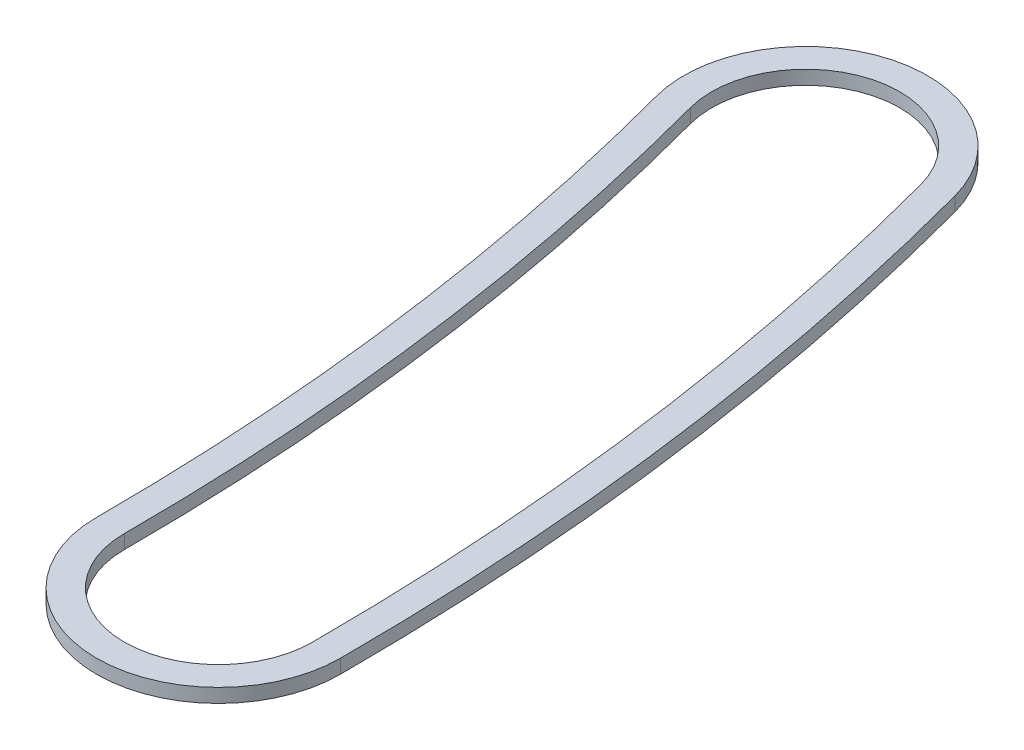
ISO-10303-21;
HEADER;
FILE_DESCRIPTION(('STEP AP214'),'2;1');
FILE_NAME('part.step','',(''),(''),'','','');
FILE_SCHEMA(('AUTOMOTIVE_DESIGN { 1 0 10303 214 1 1 1 1 }'));
ENDSEC;
DATA;
#1=APPLICATION_CONTEXT('core data for automotive mechanical design processes');
#2=APPLICATION_PROTOCOL_DEFINITION('international standard','automotive_design',2000,#1);
#3=PRODUCT_CONTEXT('',#1,'mechanical');
#4=PRODUCT('Part','Part','',(#3));
#5=PRODUCT_RELATED_PRODUCT_CATEGORY('part','',(#4));
#6=PRODUCT_DEFINITION_FORMATION('','',#4);
#7=PRODUCT_DEFINITION_CONTEXT('part definition',#1,'design');
#8=PRODUCT_DEFINITION('design','',#6,#7);
#9=PRODUCT_DEFINITION_SHAPE('','',#8);
#10=(LENGTH_UNIT() NAMED_UNIT(*) SI_UNIT(.MILLI.,.METRE.));
#11=(NAMED_UNIT(*) PLANE_ANGLE_UNIT() SI_UNIT($,.RADIAN.));
#12=(NAMED_UNIT(*) SI_UNIT($,.STERADIAN.) SOLID_ANGLE_UNIT());
#13=UNCERTAINTY_MEASURE_WITH_UNIT(LENGTH_MEASURE(1.E-05),#10,'distance_accuracy_value','');
#14=(GEOMETRIC_REPRESENTATION_CONTEXT(3) GLOBAL_UNCERTAINTY_ASSIGNED_CONTEXT((#13)) GLOBAL_UNIT_ASSIGNED_CONTEXT((#10,
#11,#12)) REPRESENTATION_CONTEXT('',''));
#15=CARTESIAN_POINT('',(0.,0.,0.));
#16=DIRECTION('',(0.,0.,1.));
#17=DIRECTION('',(1.,0.,0.));
#18=AXIS2_PLACEMENT_3D('',#15,#16,#17);
#19=CARTESIAN_POINT('',(47.625,0.508,0.));
#20=DIRECTION('',(0.,1.,0.));
#21=DIRECTION('',(0.,0.,1.));
#22=AXIS2_PLACEMENT_3D('',#19,#20,#21);
#23=PLANE('',#22);
#24=CARTESIAN_POINT('',(95.25,0.508,0.));
#25=DIRECTION('',(0.,1.,0.));
#26=DIRECTION('',(0.,0.,1.));
#27=AXIS2_PLACEMENT_3D('',#24,#25,#26);
#28=CIRCLE('',#27,4.44500000000002);
#29=CARTESIAN_POINT('',(90.805,0.508,0.));
#30=VERTEX_POINT('',#29);
#31=CARTESIAN_POINT('',(99.695,0.508,0.));
#32=VERTEX_POINT('',#31);
#33=EDGE_CURVE('E133',#30,#32,#28,.T.);
#34=ORIENTED_EDGE('',*,*,#33,.T.);
#35=CARTESIAN_POINT('',(0.,0.508,0.));
#36=DIRECTION('',(0.,1.,0.));
#37=DIRECTION('',(0.,0.,1.));
#38=AXIS2_PLACEMENT_3D('',#35,#36,#37);
#39=CIRCLE('',#38,99.695);
#40=CARTESIAN_POINT('',(96.2979752518885,0.508,-25.8029647014966));
#41=VERTEX_POINT('',#40);
#42=EDGE_CURVE('E136',#32,#41,#39,.T.);
#43=ORIENTED_EDGE('',*,*,#42,.T.);
#44=CARTESIAN_POINT('',(92.0044349540336,0.508,-24.6525140460158));
#45=DIRECTION('',(0.,1.,0.));
#46=DIRECTION('',(0.,0.,1.));
#47=AXIS2_PLACEMENT_3D('',#44,#45,#46);
#48=CIRCLE('',#47,4.44500000000002);
#49=CARTESIAN_POINT('',(87.7108946561787,0.508,-23.5020633905351));
#50=VERTEX_POINT('',#49);
#51=EDGE_CURVE('E139',#41,#50,#48,.T.);
#52=ORIENTED_EDGE('',*,*,#51,.T.);
#53=CARTESIAN_POINT('',(0.,0.508,0.));
#54=DIRECTION('',(0.,-1.,0.));
#55=DIRECTION('',(0.,0.,1.));
#56=AXIS2_PLACEMENT_3D('',#53,#54,#55);
#57=CIRCLE('',#56,90.805);
#58=EDGE_CURVE('E141',#50,#30,#57,.T.);
#59=ORIENTED_EDGE('',*,*,#58,.T.);
#60=EDGE_LOOP('',(#34,#43,#52,#59));
#61=FACE_BOUND('',#60,.T.);
#62=CARTESIAN_POINT('',(0.,0.508,0.));
#63=DIRECTION('',(0.,1.,0.));
#64=DIRECTION('',(0.,0.,1.));
#65=AXIS2_PLACEMENT_3D('',#62,#63,#64);
#66=CIRCLE('',#65,98.679);
#67=CARTESIAN_POINT('',(98.679,0.508,0.));
#68=VERTEX_POINT('',#67);
#69=CARTESIAN_POINT('',(95.3165946123788,0.508,-25.5400045516724));
#70=VERTEX_POINT('',#69);
#71=EDGE_CURVE('E105',#68,#70,#66,.T.);
#72=ORIENTED_EDGE('',*,*,#71,.F.);
#73=CARTESIAN_POINT('',(95.25,0.508,0.));
#74=DIRECTION('',(0.,1.,0.));
#75=DIRECTION('',(0.,0.,1.));
#76=AXIS2_PLACEMENT_3D('',#73,#74,#75);
#77=CIRCLE('',#76,3.429);
#78=CARTESIAN_POINT('',(91.821,0.508,0.));
#79=VERTEX_POINT('',#78);
#80=EDGE_CURVE('E97',#79,#68,#77,.T.);
#81=ORIENTED_EDGE('',*,*,#80,.F.);
#82=CARTESIAN_POINT('',(0.,0.508,0.));
#83=DIRECTION('',(0.,-1.,0.));
#84=DIRECTION('',(0.,0.,1.));
#85=AXIS2_PLACEMENT_3D('',#82,#83,#84);
#86=CIRCLE('',#85,91.821);
#87=CARTESIAN_POINT('',(88.6922752956884,0.508,-23.7650235403593));
#88=VERTEX_POINT('',#87);
#89=EDGE_CURVE('E119',#88,#79,#86,.T.);
#90=ORIENTED_EDGE('',*,*,#89,.F.);
#91=CARTESIAN_POINT('',(92.0044349540336,0.508,-24.6525140460158));
#92=DIRECTION('',(0.,1.,0.));
#93=DIRECTION('',(0.,0.,1.));
#94=AXIS2_PLACEMENT_3D('',#91,#92,#93);
#95=CIRCLE('',#94,3.429);
#96=EDGE_CURVE('E117',#70,#88,#95,.T.);
#97=ORIENTED_EDGE('',*,*,#96,.F.);
#98=EDGE_LOOP('',(#72,#81,#90,#97));
#99=FACE_BOUND('',#98,.T.);
#100=ADVANCED_FACE('F32',(#61,#99),#23,.T.);
#101=CARTESIAN_POINT('',(47.625,0.,0.));
#102=DIRECTION('',(0.,1.,0.));
#103=DIRECTION('',(0.,0.,1.));
#104=AXIS2_PLACEMENT_3D('',#101,#102,#103);
#105=PLANE('',#104);
#106=CARTESIAN_POINT('',(95.25,0.,0.));
#107=DIRECTION('',(0.,1.,0.));
#108=DIRECTION('',(0.,0.,1.));
#109=AXIS2_PLACEMENT_3D('',#106,#107,#108);
#110=CIRCLE('',#109,4.44500000000002);
#111=CARTESIAN_POINT('',(90.805,0.,0.));
#112=VERTEX_POINT('',#111);
#113=CARTESIAN_POINT('',(99.695,0.,0.));
#114=VERTEX_POINT('',#113);
#115=EDGE_CURVE('E113',#112,#114,#110,.T.);
#116=ORIENTED_EDGE('',*,*,#115,.F.);
#117=CARTESIAN_POINT('',(0.,0.,0.));
#118=DIRECTION('',(0.,-1.,0.));
#119=DIRECTION('',(0.,0.,1.));
#120=AXIS2_PLACEMENT_3D('',#117,#118,#119);
#121=CIRCLE('',#120,90.805);
#122=CARTESIAN_POINT('',(87.7108946561787,0.,-23.5020633905351));
#123=VERTEX_POINT('',#122);
#124=EDGE_CURVE('E137',#123,#112,#121,.T.);
#125=ORIENTED_EDGE('',*,*,#124,.F.);
#126=CARTESIAN_POINT('',(92.0044349540336,0.,-24.6525140460158));
#127=DIRECTION('',(0.,1.,0.));
#128=DIRECTION('',(0.,0.,1.));
#129=AXIS2_PLACEMENT_3D('',#126,#127,#128);
#130=CIRCLE('',#129,4.44500000000002);
#131=CARTESIAN_POINT('',(96.2979752518885,0.,-25.8029647014966));
#132=VERTEX_POINT('',#131);
#133=EDGE_CURVE('E148',#132,#123,#130,.T.);
#134=ORIENTED_EDGE('',*,*,#133,.F.);
#135=CARTESIAN_POINT('',(0.,0.,0.));
#136=DIRECTION('',(0.,1.,0.));
#137=DIRECTION('',(0.,0.,1.));
#138=AXIS2_PLACEMENT_3D('',#135,#136,#137);
#139=CIRCLE('',#138,99.695);
#140=EDGE_CURVE('E146',#114,#132,#139,.T.);
#141=ORIENTED_EDGE('',*,*,#140,.F.);
#142=EDGE_LOOP('',(#116,#125,#134,#141));
#143=FACE_BOUND('',#142,.T.);
#144=CARTESIAN_POINT('',(95.25,0.,0.));
#145=DIRECTION('',(0.,1.,0.));
#146=DIRECTION('',(0.,0.,1.));
#147=AXIS2_PLACEMENT_3D('',#144,#145,#146);
#148=CIRCLE('',#147,3.429);
#149=CARTESIAN_POINT('',(91.821,0.,0.));
#150=VERTEX_POINT('',#149);
#151=CARTESIAN_POINT('',(98.679,0.,0.));
#152=VERTEX_POINT('',#151);
#153=EDGE_CURVE('E55',#150,#152,#148,.T.);
#154=ORIENTED_EDGE('',*,*,#153,.T.);
#155=CARTESIAN_POINT('',(0.,0.,0.));
#156=DIRECTION('',(0.,1.,0.));
#157=DIRECTION('',(0.,0.,1.));
#158=AXIS2_PLACEMENT_3D('',#155,#156,#157);
#159=CIRCLE('',#158,98.679);
#160=CARTESIAN_POINT('',(95.3165946123788,0.,-25.5400045516724));
#161=VERTEX_POINT('',#160);
#162=EDGE_CURVE('E112',#152,#161,#159,.T.);
#163=ORIENTED_EDGE('',*,*,#162,.T.);
#164=CARTESIAN_POINT('',(92.0044349540336,0.,-24.6525140460158));
#165=DIRECTION('',(0.,1.,0.));
#166=DIRECTION('',(0.,0.,1.));
#167=AXIS2_PLACEMENT_3D('',#164,#165,#166);
#168=CIRCLE('',#167,3.429);
#169=CARTESIAN_POINT('',(88.6922752956884,0.,-23.7650235403593));
#170=VERTEX_POINT('',#169);
#171=EDGE_CURVE('E125',#161,#170,#168,.T.);
#172=ORIENTED_EDGE('',*,*,#171,.T.);
#173=CARTESIAN_POINT('',(0.,0.,0.));
#174=DIRECTION('',(0.,-1.,0.));
#175=DIRECTION('',(0.,0.,1.));
#176=AXIS2_PLACEMENT_3D('',#173,#174,#175);
#177=CIRCLE('',#176,91.821);
#178=EDGE_CURVE('E106',#170,#150,#177,.T.);
#179=ORIENTED_EDGE('',*,*,#178,.T.);
#180=EDGE_LOOP('',(#154,#163,#172,#179));
#181=FACE_BOUND('',#180,.T.);
#182=ADVANCED_FACE('F166',(#143,#181),#105,.F.);
#183=CARTESIAN_POINT('',(95.25,0.508,0.));
#184=DIRECTION('',(0.,-1.,0.));
#185=DIRECTION('',(0.,0.,-1.));
#186=AXIS2_PLACEMENT_3D('',#183,#184,#185);
#187=CYLINDRICAL_SURFACE('',#186,4.44500000000002);
#188=ORIENTED_EDGE('',*,*,#115,.T.);
#189=DIRECTION('',(0.,-1.,0.));
#190=VECTOR('',#189,1.);
#191=CARTESIAN_POINT('',(99.695,0.508,0.));
#192=LINE('',#191,#190);
#193=EDGE_CURVE('E11',#32,#114,#192,.T.);
#194=ORIENTED_EDGE('',*,*,#193,.F.);
#195=ORIENTED_EDGE('',*,*,#33,.F.);
#196=DIRECTION('',(0.,-1.,0.));
#197=VECTOR('',#196,1.);
#198=CARTESIAN_POINT('',(90.805,0.508,0.));
#199=LINE('',#198,#197);
#200=EDGE_CURVE('E143',#30,#112,#199,.T.);
#201=ORIENTED_EDGE('',*,*,#200,.T.);
#202=EDGE_LOOP('',(#188,#194,#195,#201));
#203=FACE_BOUND('',#202,.T.);
#204=ADVANCED_FACE('F34',(#203),#187,.T.);
#205=CARTESIAN_POINT('',(0.,0.508,0.));
#206=DIRECTION('',(0.,-1.,0.));
#207=DIRECTION('',(0.,0.,-1.));
#208=AXIS2_PLACEMENT_3D('',#205,#206,#207);
#209=CYLINDRICAL_SURFACE('',#208,99.695);
#210=ORIENTED_EDGE('',*,*,#140,.T.);
#211=DIRECTION('',(0.,-1.,0.));
#212=VECTOR('',#211,1.);
#213=CARTESIAN_POINT('',(96.2979752518885,0.508,-25.8029647014966));
#214=LINE('',#213,#212);
#215=EDGE_CURVE('E40',#41,#132,#214,.T.);
#216=ORIENTED_EDGE('',*,*,#215,.F.);
#217=ORIENTED_EDGE('',*,*,#42,.F.);
#218=ORIENTED_EDGE('',*,*,#193,.T.);
#219=EDGE_LOOP('',(#210,#216,#217,#218));
#220=FACE_BOUND('',#219,.T.);
#221=ADVANCED_FACE('F176',(#220),#209,.T.);
#222=CARTESIAN_POINT('',(92.0044349540336,0.508,-24.6525140460158));
#223=DIRECTION('',(0.,-1.,0.));
#224=DIRECTION('',(0.,0.,-1.));
#225=AXIS2_PLACEMENT_3D('',#222,#223,#224);
#226=CYLINDRICAL_SURFACE('',#225,4.44500000000002);
#227=ORIENTED_EDGE('',*,*,#133,.T.);
#228=DIRECTION('',(0.,-1.,0.));
#229=VECTOR('',#228,1.);
#230=CARTESIAN_POINT('',(87.7108946561787,0.508,-23.5020633905351));
#231=LINE('',#230,#229);
#232=EDGE_CURVE('E153',#50,#123,#231,.T.);
#233=ORIENTED_EDGE('',*,*,#232,.F.);
#234=ORIENTED_EDGE('',*,*,#51,.F.);
#235=ORIENTED_EDGE('',*,*,#215,.T.);
#236=EDGE_LOOP('',(#227,#233,#234,#235));
#237=FACE_BOUND('',#236,.T.);
#238=ADVANCED_FACE('F160',(#237),#226,.T.);
#239=CARTESIAN_POINT('',(0.,0.508,0.));
#240=DIRECTION('',(0.,-1.,0.));
#241=DIRECTION('',(0.,0.,-1.));
#242=AXIS2_PLACEMENT_3D('',#239,#240,#241);
#243=CYLINDRICAL_SURFACE('',#242,90.805);
#244=ORIENTED_EDGE('',*,*,#124,.T.);
#245=ORIENTED_EDGE('',*,*,#200,.F.);
#246=ORIENTED_EDGE('',*,*,#58,.F.);
#247=ORIENTED_EDGE('',*,*,#232,.T.);
#248=EDGE_LOOP('',(#244,#245,#246,#247));
#249=FACE_BOUND('',#248,.T.);
#250=ADVANCED_FACE('F170',(#249),#243,.F.);
#251=CARTESIAN_POINT('',(95.25,0.508,0.));
#252=DIRECTION('',(0.,-1.,0.));
#253=DIRECTION('',(0.,0.,-1.));
#254=AXIS2_PLACEMENT_3D('',#251,#252,#253);
#255=CYLINDRICAL_SURFACE('',#254,3.429);
#256=ORIENTED_EDGE('',*,*,#153,.F.);
#257=DIRECTION('',(0.,-1.,0.));
#258=VECTOR('',#257,1.);
#259=CARTESIAN_POINT('',(91.821,0.508,0.));
#260=LINE('',#259,#258);
#261=EDGE_CURVE('E101',#79,#150,#260,.T.);
#262=ORIENTED_EDGE('',*,*,#261,.F.);
#263=ORIENTED_EDGE('',*,*,#80,.T.);
#264=DIRECTION('',(0.,-1.,0.));
#265=VECTOR('',#264,1.);
#266=CARTESIAN_POINT('',(98.679,0.508,0.));
#267=LINE('',#266,#265);
#268=EDGE_CURVE('E100',#68,#152,#267,.T.);
#269=ORIENTED_EDGE('',*,*,#268,.T.);
#270=EDGE_LOOP('',(#256,#262,#263,#269));
#271=FACE_BOUND('',#270,.T.);
#272=ADVANCED_FACE('F99',(#271),#255,.F.);
#273=CARTESIAN_POINT('',(0.,0.508,0.));
#274=DIRECTION('',(0.,-1.,0.));
#275=DIRECTION('',(0.,0.,-1.));
#276=AXIS2_PLACEMENT_3D('',#273,#274,#275);
#277=CYLINDRICAL_SURFACE('',#276,98.679);
#278=ORIENTED_EDGE('',*,*,#162,.F.);
#279=ORIENTED_EDGE('',*,*,#268,.F.);
#280=ORIENTED_EDGE('',*,*,#71,.T.);
#281=DIRECTION('',(0.,-1.,0.));
#282=VECTOR('',#281,1.);
#283=CARTESIAN_POINT('',(95.3165946123788,0.508,-25.5400045516724));
#284=LINE('',#283,#282);
#285=EDGE_CURVE('E114',#70,#161,#284,.T.);
#286=ORIENTED_EDGE('',*,*,#285,.T.);
#287=EDGE_LOOP('',(#278,#279,#280,#286));
#288=FACE_BOUND('',#287,.T.);
#289=ADVANCED_FACE('F109',(#288),#277,.F.);
#290=CARTESIAN_POINT('',(92.0044349540336,0.508,-24.6525140460158));
#291=DIRECTION('',(0.,-1.,0.));
#292=DIRECTION('',(0.,0.,-1.));
#293=AXIS2_PLACEMENT_3D('',#290,#291,#292);
#294=CYLINDRICAL_SURFACE('',#293,3.429);
#295=ORIENTED_EDGE('',*,*,#171,.F.);
#296=ORIENTED_EDGE('',*,*,#285,.F.);
#297=ORIENTED_EDGE('',*,*,#96,.T.);
#298=DIRECTION('',(0.,-1.,0.));
#299=VECTOR('',#298,1.);
#300=CARTESIAN_POINT('',(88.6922752956884,0.508,-23.7650235403593));
#301=LINE('',#300,#299);
#302=EDGE_CURVE('E47',#88,#170,#301,.T.);
#303=ORIENTED_EDGE('',*,*,#302,.T.);
#304=EDGE_LOOP('',(#295,#296,#297,#303));
#305=FACE_BOUND('',#304,.T.);
#306=ADVANCED_FACE('F199',(#305),#294,.F.);
#307=CARTESIAN_POINT('',(0.,0.508,0.));
#308=DIRECTION('',(0.,-1.,0.));
#309=DIRECTION('',(0.,0.,-1.));
#310=AXIS2_PLACEMENT_3D('',#307,#308,#309);
#311=CYLINDRICAL_SURFACE('',#310,91.821);
#312=ORIENTED_EDGE('',*,*,#178,.F.);
#313=ORIENTED_EDGE('',*,*,#302,.F.);
#314=ORIENTED_EDGE('',*,*,#89,.T.);
#315=ORIENTED_EDGE('',*,*,#261,.T.);
#316=EDGE_LOOP('',(#312,#313,#314,#315));
#317=FACE_BOUND('',#316,.T.);
#318=ADVANCED_FACE('F203',(#317),#311,.T.);
#319=CLOSED_SHELL('',(#100,#182,#204,#221,#238,#250,#272,#289,#306,#318));
#320=MANIFOLD_SOLID_BREP('B2',#319);
#321=ADVANCED_BREP_SHAPE_REPRESENTATION('',(#18,#320),#14);
#322=SHAPE_DEFINITION_REPRESENTATION(#9,#321);
ENDSEC;
END-ISO-10303-21;
